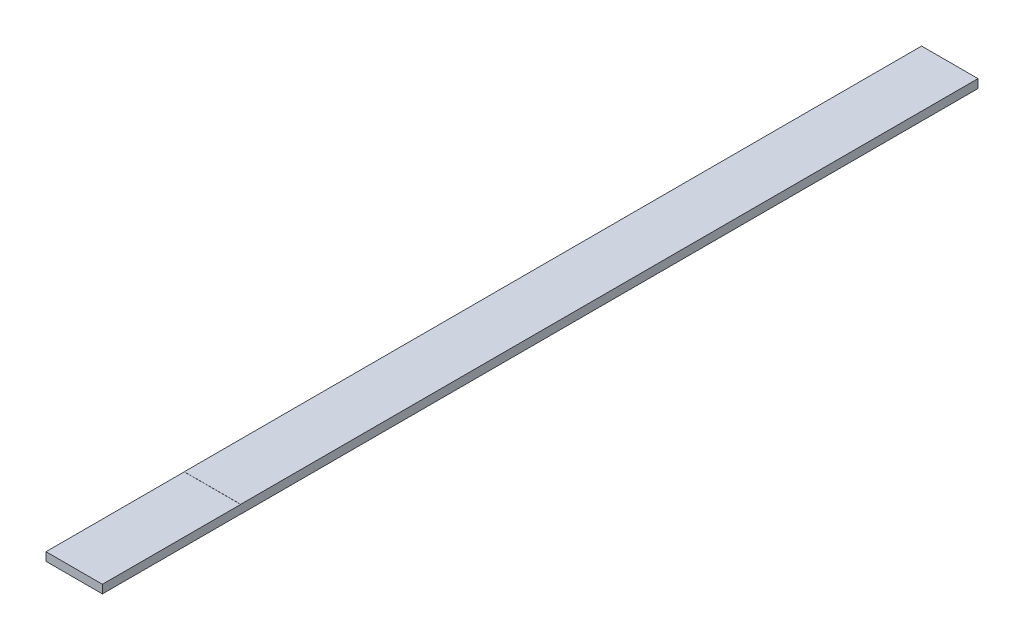
ISO-10303-21;
HEADER;
FILE_DESCRIPTION(('STEP AP214'),'2;1');
FILE_NAME('part.step','',(''),(''),'','','');
FILE_SCHEMA(('AUTOMOTIVE_DESIGN { 1 0 10303 214 1 1 1 1 }'));
ENDSEC;
DATA;
#1=APPLICATION_CONTEXT('core data for automotive mechanical design processes');
#2=APPLICATION_PROTOCOL_DEFINITION('international standard','automotive_design',2000,#1);
#3=PRODUCT_CONTEXT('',#1,'mechanical');
#4=PRODUCT('Part','Part','',(#3));
#5=PRODUCT_RELATED_PRODUCT_CATEGORY('part','',(#4));
#6=PRODUCT_DEFINITION_FORMATION('','',#4);
#7=PRODUCT_DEFINITION_CONTEXT('part definition',#1,'design');
#8=PRODUCT_DEFINITION('design','',#6,#7);
#9=PRODUCT_DEFINITION_SHAPE('','',#8);
#10=(LENGTH_UNIT() NAMED_UNIT(*) SI_UNIT(.MILLI.,.METRE.));
#11=(NAMED_UNIT(*) PLANE_ANGLE_UNIT() SI_UNIT($,.RADIAN.));
#12=(NAMED_UNIT(*) SI_UNIT($,.STERADIAN.) SOLID_ANGLE_UNIT());
#13=UNCERTAINTY_MEASURE_WITH_UNIT(LENGTH_MEASURE(1.E-05),#10,'distance_accuracy_value','');
#14=(GEOMETRIC_REPRESENTATION_CONTEXT(3) GLOBAL_UNCERTAINTY_ASSIGNED_CONTEXT((#13)) GLOBAL_UNIT_ASSIGNED_CONTEXT((#10,
#11,#12)) REPRESENTATION_CONTEXT('',''));
#15=CARTESIAN_POINT('',(0.,0.,0.));
#16=DIRECTION('',(0.,0.,1.));
#17=DIRECTION('',(1.,0.,0.));
#18=AXIS2_PLACEMENT_3D('',#15,#16,#17);
#19=CARTESIAN_POINT('',(18.,2.75,558.8));
#20=DIRECTION('',(-1.,0.,0.));
#21=DIRECTION('',(0.,0.,1.));
#22=AXIS2_PLACEMENT_3D('',#19,#20,#21);
#23=PLANE('',#22);
#24=DIRECTION('',(0.,0.,-1.));
#25=VECTOR('',#24,1.);
#26=CARTESIAN_POINT('',(18.,2.75,558.8));
#27=LINE('',#26,#25);
#28=CARTESIAN_POINT('',(18.,2.75,470.55));
#29=VERTEX_POINT('',#28);
#30=CARTESIAN_POINT('',(18.,2.75,0.));
#31=VERTEX_POINT('',#30);
#32=EDGE_CURVE('E11',#29,#31,#27,.T.);
#33=ORIENTED_EDGE('',*,*,#32,.F.);
#34=DIRECTION('',(0.,1.,0.));
#35=VECTOR('',#34,1.);
#36=CARTESIAN_POINT('',(18.,2.75,470.55));
#37=LINE('',#36,#35);
#38=CARTESIAN_POINT('',(18.,2.68142,470.55));
#39=VERTEX_POINT('',#38);
#40=EDGE_CURVE('E118',#39,#29,#37,.T.);
#41=ORIENTED_EDGE('',*,*,#40,.F.);
#42=DIRECTION('',(0.,0.,-1.));
#43=VECTOR('',#42,1.);
#44=CARTESIAN_POINT('',(18.,2.68142,558.8));
#45=LINE('',#44,#43);
#46=CARTESIAN_POINT('',(18.,2.68142,558.8));
#47=VERTEX_POINT('',#46);
#48=EDGE_CURVE('E101',#47,#39,#45,.T.);
#49=ORIENTED_EDGE('',*,*,#48,.F.);
#50=DIRECTION('',(0.,1.,0.));
#51=VECTOR('',#50,1.);
#52=CARTESIAN_POINT('',(18.,2.75,558.8));
#53=LINE('',#52,#51);
#54=CARTESIAN_POINT('',(18.,-2.68142,558.8));
#55=VERTEX_POINT('',#54);
#56=EDGE_CURVE('E141',#55,#47,#53,.T.);
#57=ORIENTED_EDGE('',*,*,#56,.F.);
#58=DIRECTION('',(0.,0.,1.));
#59=VECTOR('',#58,1.);
#60=CARTESIAN_POINT('',(18.,-2.68142,558.8));
#61=LINE('',#60,#59);
#62=CARTESIAN_POINT('',(18.,-2.68142,470.55));
#63=VERTEX_POINT('',#62);
#64=EDGE_CURVE('E57',#63,#55,#61,.T.);
#65=ORIENTED_EDGE('',*,*,#64,.F.);
#66=DIRECTION('',(0.,1.,0.));
#67=VECTOR('',#66,1.);
#68=CARTESIAN_POINT('',(18.,-2.75,470.55));
#69=LINE('',#68,#67);
#70=CARTESIAN_POINT('',(18.,-2.75,470.55));
#71=VERTEX_POINT('',#70);
#72=EDGE_CURVE('E123',#71,#63,#69,.T.);
#73=ORIENTED_EDGE('',*,*,#72,.F.);
#74=DIRECTION('',(0.,0.,-1.));
#75=VECTOR('',#74,1.);
#76=CARTESIAN_POINT('',(18.,-2.75,558.8));
#77=LINE('',#76,#75);
#78=CARTESIAN_POINT('',(18.,-2.75,0.));
#79=VERTEX_POINT('',#78);
#80=EDGE_CURVE('E146',#71,#79,#77,.T.);
#81=ORIENTED_EDGE('',*,*,#80,.T.);
#82=DIRECTION('',(0.,1.,0.));
#83=VECTOR('',#82,1.);
#84=CARTESIAN_POINT('',(18.,2.75,0.));
#85=LINE('',#84,#83);
#86=EDGE_CURVE('E137',#79,#31,#85,.T.);
#87=ORIENTED_EDGE('',*,*,#86,.T.);
#88=EDGE_LOOP('',(#33,#41,#49,#57,#65,#73,#81,#87));
#89=FACE_BOUND('',#88,.T.);
#90=ADVANCED_FACE('F35',(#89),#23,.F.);
#91=CARTESIAN_POINT('',(-18.,2.75,558.8));
#92=DIRECTION('',(0.,-1.,0.));
#93=DIRECTION('',(0.,0.,-1.));
#94=AXIS2_PLACEMENT_3D('',#91,#92,#93);
#95=PLANE('',#94);
#96=DIRECTION('',(0.,0.,-1.));
#97=VECTOR('',#96,1.);
#98=CARTESIAN_POINT('',(-18.,2.75,558.8));
#99=LINE('',#98,#97);
#100=CARTESIAN_POINT('',(-18.,2.75,470.55));
#101=VERTEX_POINT('',#100);
#102=CARTESIAN_POINT('',(-18.,2.75,0.));
#103=VERTEX_POINT('',#102);
#104=EDGE_CURVE('E42',#101,#103,#99,.T.);
#105=ORIENTED_EDGE('',*,*,#104,.F.);
#106=DIRECTION('',(1.,0.,0.));
#107=VECTOR('',#106,1.);
#108=CARTESIAN_POINT('',(-18.,2.75,470.55));
#109=LINE('',#108,#107);
#110=EDGE_CURVE('E104',#101,#29,#109,.T.);
#111=ORIENTED_EDGE('',*,*,#110,.T.);
#112=ORIENTED_EDGE('',*,*,#32,.T.);
#113=DIRECTION('',(-1.,0.,0.));
#114=VECTOR('',#113,1.);
#115=CARTESIAN_POINT('',(-18.,2.75,0.));
#116=LINE('',#115,#114);
#117=EDGE_CURVE('E149',#31,#103,#116,.T.);
#118=ORIENTED_EDGE('',*,*,#117,.T.);
#119=EDGE_LOOP('',(#105,#111,#112,#118));
#120=FACE_BOUND('',#119,.T.);
#121=ADVANCED_FACE('F164',(#120),#95,.F.);
#122=CARTESIAN_POINT('',(-18.,2.75,558.8));
#123=DIRECTION('',(1.,0.,0.));
#124=DIRECTION('',(0.,0.,-1.));
#125=AXIS2_PLACEMENT_3D('',#122,#123,#124);
#126=PLANE('',#125);
#127=DIRECTION('',(0.,0.,-1.));
#128=VECTOR('',#127,1.);
#129=CARTESIAN_POINT('',(-18.,2.68142,558.8));
#130=LINE('',#129,#128);
#131=CARTESIAN_POINT('',(-18.,2.68142,558.8));
#132=VERTEX_POINT('',#131);
#133=CARTESIAN_POINT('',(-18.,2.68142,470.55));
#134=VERTEX_POINT('',#133);
#135=EDGE_CURVE('E49',#132,#134,#130,.T.);
#136=ORIENTED_EDGE('',*,*,#135,.T.);
#137=DIRECTION('',(0.,1.,0.));
#138=VECTOR('',#137,1.);
#139=CARTESIAN_POINT('',(-18.,2.75,470.55));
#140=LINE('',#139,#138);
#141=EDGE_CURVE('E108',#134,#101,#140,.T.);
#142=ORIENTED_EDGE('',*,*,#141,.T.);
#143=ORIENTED_EDGE('',*,*,#104,.T.);
#144=DIRECTION('',(0.,-1.,0.));
#145=VECTOR('',#144,1.);
#146=CARTESIAN_POINT('',(-18.,2.75,0.));
#147=LINE('',#146,#145);
#148=CARTESIAN_POINT('',(-18.,-2.75,0.));
#149=VERTEX_POINT('',#148);
#150=EDGE_CURVE('E152',#103,#149,#147,.T.);
#151=ORIENTED_EDGE('',*,*,#150,.T.);
#152=DIRECTION('',(0.,0.,-1.));
#153=VECTOR('',#152,1.);
#154=CARTESIAN_POINT('',(-18.,-2.75,558.8));
#155=LINE('',#154,#153);
#156=CARTESIAN_POINT('',(-18.,-2.75,470.55));
#157=VERTEX_POINT('',#156);
#158=EDGE_CURVE('E158',#157,#149,#155,.T.);
#159=ORIENTED_EDGE('',*,*,#158,.F.);
#160=DIRECTION('',(0.,1.,0.));
#161=VECTOR('',#160,1.);
#162=CARTESIAN_POINT('',(-18.,-2.75,470.55));
#163=LINE('',#162,#161);
#164=CARTESIAN_POINT('',(-18.,-2.68142,470.55));
#165=VERTEX_POINT('',#164);
#166=EDGE_CURVE('E126',#157,#165,#163,.T.);
#167=ORIENTED_EDGE('',*,*,#166,.T.);
#168=DIRECTION('',(0.,0.,1.));
#169=VECTOR('',#168,1.);
#170=CARTESIAN_POINT('',(-18.,-2.68142,558.8));
#171=LINE('',#170,#169);
#172=CARTESIAN_POINT('',(-18.,-2.68142,558.8));
#173=VERTEX_POINT('',#172);
#174=EDGE_CURVE('E129',#165,#173,#171,.T.);
#175=ORIENTED_EDGE('',*,*,#174,.T.);
#176=DIRECTION('',(0.,-1.,0.));
#177=VECTOR('',#176,1.);
#178=CARTESIAN_POINT('',(-18.,2.75,558.8));
#179=LINE('',#178,#177);
#180=EDGE_CURVE('E117',#132,#173,#179,.T.);
#181=ORIENTED_EDGE('',*,*,#180,.F.);
#182=EDGE_LOOP('',(#136,#142,#143,#151,#159,#167,#175,#181));
#183=FACE_BOUND('',#182,.T.);
#184=ADVANCED_FACE('F115',(#183),#126,.F.);
#185=CARTESIAN_POINT('',(-18.,-2.75,558.8));
#186=DIRECTION('',(0.,1.,0.));
#187=DIRECTION('',(0.,0.,1.));
#188=AXIS2_PLACEMENT_3D('',#185,#186,#187);
#189=PLANE('',#188);
#190=ORIENTED_EDGE('',*,*,#80,.F.);
#191=DIRECTION('',(1.,0.,0.));
#192=VECTOR('',#191,1.);
#193=CARTESIAN_POINT('',(-18.,-2.75,470.55));
#194=LINE('',#193,#192);
#195=EDGE_CURVE('E131',#157,#71,#194,.T.);
#196=ORIENTED_EDGE('',*,*,#195,.F.);
#197=ORIENTED_EDGE('',*,*,#158,.T.);
#198=DIRECTION('',(1.,0.,0.));
#199=VECTOR('',#198,1.);
#200=CARTESIAN_POINT('',(-18.,-2.75,0.));
#201=LINE('',#200,#199);
#202=EDGE_CURVE('E144',#149,#79,#201,.T.);
#203=ORIENTED_EDGE('',*,*,#202,.T.);
#204=EDGE_LOOP('',(#190,#196,#197,#203));
#205=FACE_BOUND('',#204,.T.);
#206=ADVANCED_FACE('F171',(#205),#189,.F.);
#207=CARTESIAN_POINT('',(18.,-2.75,558.8));
#208=DIRECTION('',(0.,0.,1.));
#209=DIRECTION('',(1.,0.,0.));
#210=AXIS2_PLACEMENT_3D('',#207,#208,#209);
#211=PLANE('',#210);
#212=DIRECTION('',(1.,0.,0.));
#213=VECTOR('',#212,1.);
#214=CARTESIAN_POINT('',(-18.,2.68142,558.8));
#215=LINE('',#214,#213);
#216=EDGE_CURVE('E105',#132,#47,#215,.T.);
#217=ORIENTED_EDGE('',*,*,#216,.F.);
#218=ORIENTED_EDGE('',*,*,#180,.T.);
#219=DIRECTION('',(1.,0.,0.));
#220=VECTOR('',#219,1.);
#221=CARTESIAN_POINT('',(-18.,-2.68142,558.8));
#222=LINE('',#221,#220);
#223=EDGE_CURVE('E135',#173,#55,#222,.T.);
#224=ORIENTED_EDGE('',*,*,#223,.T.);
#225=ORIENTED_EDGE('',*,*,#56,.T.);
#226=EDGE_LOOP('',(#217,#218,#224,#225));
#227=FACE_BOUND('',#226,.T.);
#228=ADVANCED_FACE('F180',(#227),#211,.T.);
#229=CARTESIAN_POINT('',(18.,-2.75,0.));
#230=DIRECTION('',(0.,0.,1.));
#231=DIRECTION('',(1.,0.,0.));
#232=AXIS2_PLACEMENT_3D('',#229,#230,#231);
#233=PLANE('',#232);
#234=ORIENTED_EDGE('',*,*,#86,.F.);
#235=ORIENTED_EDGE('',*,*,#202,.F.);
#236=ORIENTED_EDGE('',*,*,#150,.F.);
#237=ORIENTED_EDGE('',*,*,#117,.F.);
#238=EDGE_LOOP('',(#234,#235,#236,#237));
#239=FACE_BOUND('',#238,.T.);
#240=ADVANCED_FACE('F168',(#239),#233,.F.);
#241=CARTESIAN_POINT('',(-18.,-2.68142,558.8));
#242=DIRECTION('',(0.,1.,0.));
#243=DIRECTION('',(0.,0.,1.));
#244=AXIS2_PLACEMENT_3D('',#241,#242,#243);
#245=PLANE('',#244);
#246=ORIENTED_EDGE('',*,*,#64,.T.);
#247=ORIENTED_EDGE('',*,*,#223,.F.);
#248=ORIENTED_EDGE('',*,*,#174,.F.);
#249=DIRECTION('',(1.,0.,0.));
#250=VECTOR('',#249,1.);
#251=CARTESIAN_POINT('',(-18.,-2.68142,470.55));
#252=LINE('',#251,#250);
#253=EDGE_CURVE('E138',#165,#63,#252,.T.);
#254=ORIENTED_EDGE('',*,*,#253,.T.);
#255=EDGE_LOOP('',(#246,#247,#248,#254));
#256=FACE_BOUND('',#255,.T.);
#257=ADVANCED_FACE('F177',(#256),#245,.F.);
#258=CARTESIAN_POINT('',(-18.,-2.75,470.55));
#259=DIRECTION('',(0.,0.,-1.));
#260=DIRECTION('',(-1.,0.,0.));
#261=AXIS2_PLACEMENT_3D('',#258,#259,#260);
#262=PLANE('',#261);
#263=ORIENTED_EDGE('',*,*,#72,.T.);
#264=ORIENTED_EDGE('',*,*,#253,.F.);
#265=ORIENTED_EDGE('',*,*,#166,.F.);
#266=ORIENTED_EDGE('',*,*,#195,.T.);
#267=EDGE_LOOP('',(#263,#264,#265,#266));
#268=FACE_BOUND('',#267,.T.);
#269=ADVANCED_FACE('F175',(#268),#262,.F.);
#270=CARTESIAN_POINT('',(-18.,2.75,470.55));
#271=DIRECTION('',(0.,0.,-1.));
#272=DIRECTION('',(-1.,0.,0.));
#273=AXIS2_PLACEMENT_3D('',#270,#271,#272);
#274=PLANE('',#273);
#275=ORIENTED_EDGE('',*,*,#40,.T.);
#276=ORIENTED_EDGE('',*,*,#110,.F.);
#277=ORIENTED_EDGE('',*,*,#141,.F.);
#278=DIRECTION('',(1.,0.,0.));
#279=VECTOR('',#278,1.);
#280=CARTESIAN_POINT('',(-18.,2.68142,470.55));
#281=LINE('',#280,#279);
#282=EDGE_CURVE('E97',#134,#39,#281,.T.);
#283=ORIENTED_EDGE('',*,*,#282,.T.);
#284=EDGE_LOOP('',(#275,#276,#277,#283));
#285=FACE_BOUND('',#284,.T.);
#286=ADVANCED_FACE('F109',(#285),#274,.F.);
#287=CARTESIAN_POINT('',(-18.,2.68142,558.8));
#288=DIRECTION('',(0.,-1.,0.));
#289=DIRECTION('',(0.,0.,-1.));
#290=AXIS2_PLACEMENT_3D('',#287,#288,#289);
#291=PLANE('',#290);
#292=ORIENTED_EDGE('',*,*,#48,.T.);
#293=ORIENTED_EDGE('',*,*,#282,.F.);
#294=ORIENTED_EDGE('',*,*,#135,.F.);
#295=ORIENTED_EDGE('',*,*,#216,.T.);
#296=EDGE_LOOP('',(#292,#293,#294,#295));
#297=FACE_BOUND('',#296,.T.);
#298=ADVANCED_FACE('F99',(#297),#291,.F.);
#299=CLOSED_SHELL('',(#90,#121,#184,#206,#228,#240,#257,#269,#286,#298));
#300=MANIFOLD_SOLID_BREP('B2',#299);
#301=ADVANCED_BREP_SHAPE_REPRESENTATION('',(#18,#300),#14);
#302=SHAPE_DEFINITION_REPRESENTATION(#9,#301);
ENDSEC;
END-ISO-10303-21;
